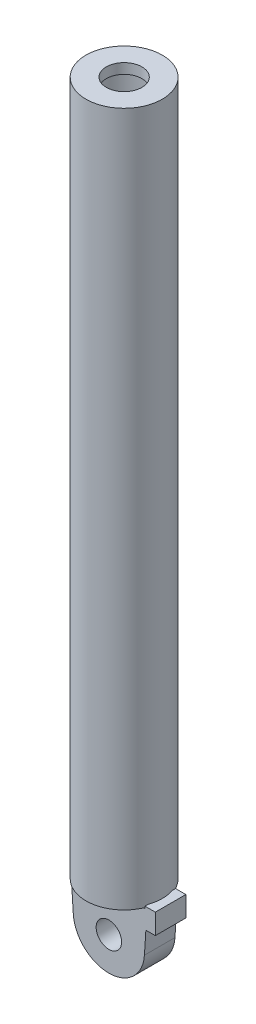
ISO-10303-21;
HEADER;
FILE_DESCRIPTION(('STEP AP214'),'2;1');
FILE_NAME('part.step','',(''),(''),'','','');
FILE_SCHEMA(('AUTOMOTIVE_DESIGN { 1 0 10303 214 1 1 1 1 }'));
ENDSEC;
DATA;
#1=APPLICATION_CONTEXT('core data for automotive mechanical design processes');
#2=APPLICATION_PROTOCOL_DEFINITION('international standard','automotive_design',2000,#1);
#3=PRODUCT_CONTEXT('',#1,'mechanical');
#4=PRODUCT('Part','Part','',(#3));
#5=PRODUCT_RELATED_PRODUCT_CATEGORY('part','',(#4));
#6=PRODUCT_DEFINITION_FORMATION('','',#4);
#7=PRODUCT_DEFINITION_CONTEXT('part definition',#1,'design');
#8=PRODUCT_DEFINITION('design','',#6,#7);
#9=PRODUCT_DEFINITION_SHAPE('','',#8);
#10=(LENGTH_UNIT() NAMED_UNIT(*) SI_UNIT(.MILLI.,.METRE.));
#11=(NAMED_UNIT(*) PLANE_ANGLE_UNIT() SI_UNIT($,.RADIAN.));
#12=(NAMED_UNIT(*) SI_UNIT($,.STERADIAN.) SOLID_ANGLE_UNIT());
#13=UNCERTAINTY_MEASURE_WITH_UNIT(LENGTH_MEASURE(1.E-05),#10,'distance_accuracy_value','');
#14=(GEOMETRIC_REPRESENTATION_CONTEXT(3) GLOBAL_UNCERTAINTY_ASSIGNED_CONTEXT((#13)) GLOBAL_UNIT_ASSIGNED_CONTEXT((#10,
#11,#12)) REPRESENTATION_CONTEXT('',''));
#15=CARTESIAN_POINT('',(0.,0.,0.));
#16=DIRECTION('',(0.,0.,1.));
#17=DIRECTION('',(1.,0.,0.));
#18=AXIS2_PLACEMENT_3D('',#15,#16,#17);
#19=CARTESIAN_POINT('',(35.5,42.,15.));
#20=DIRECTION('',(1.,0.,0.));
#21=DIRECTION('',(0.,0.,-1.));
#22=AXIS2_PLACEMENT_3D('',#19,#20,#21);
#23=PLANE('',#22);
#24=DIRECTION('',(0.,0.,-1.));
#25=VECTOR('',#24,1.);
#26=CARTESIAN_POINT('',(35.5,40.,15.));
#27=LINE('',#26,#25);
#28=CARTESIAN_POINT('',(35.5,40.,-12.0830459735943));
#29=VERTEX_POINT('',#28);
#30=CARTESIAN_POINT('',(35.5,40.,-15.));
#31=VERTEX_POINT('',#30);
#32=EDGE_CURVE('E178',#29,#31,#27,.T.);
#33=ORIENTED_EDGE('',*,*,#32,.F.);
#34=DIRECTION('',(0.,1.,0.));
#35=VECTOR('',#34,1.);
#36=CARTESIAN_POINT('',(35.5,722.,-12.083045973594));
#37=LINE('',#36,#35);
#38=CARTESIAN_POINT('',(35.5,42.,-12.0830459735943));
#39=VERTEX_POINT('',#38);
#40=EDGE_CURVE('E52',#29,#39,#37,.T.);
#41=ORIENTED_EDGE('',*,*,#40,.T.);
#42=DIRECTION('',(0.,0.,-1.));
#43=VECTOR('',#42,1.);
#44=CARTESIAN_POINT('',(35.5,42.,15.));
#45=LINE('',#44,#43);
#46=CARTESIAN_POINT('',(35.5,42.,-15.));
#47=VERTEX_POINT('',#46);
#48=EDGE_CURVE('E46',#39,#47,#45,.T.);
#49=ORIENTED_EDGE('',*,*,#48,.T.);
#50=DIRECTION('',(0.,-1.,0.));
#51=VECTOR('',#50,1.);
#52=CARTESIAN_POINT('',(35.5,42.,-15.));
#53=LINE('',#52,#51);
#54=EDGE_CURVE('E149',#47,#31,#53,.T.);
#55=ORIENTED_EDGE('',*,*,#54,.T.);
#56=EDGE_LOOP('',(#33,#41,#49,#55));
#57=FACE_BOUND('',#56,.T.);
#58=ADVANCED_FACE('F36',(#57),#23,.F.);
#59=CARTESIAN_POINT('',(-37.5,40.,15.));
#60=DIRECTION('',(0.,-1.,0.));
#61=DIRECTION('',(1.,0.,0.));
#62=AXIS2_PLACEMENT_3D('',#59,#60,#61);
#63=PLANE('',#62);
#64=CARTESIAN_POINT('',(35.5,40.,15.));
#65=VERTEX_POINT('',#64);
#66=CARTESIAN_POINT('',(35.5000000000001,40.,12.0830459735943));
#67=VERTEX_POINT('',#66);
#68=EDGE_CURVE('E179',#65,#67,#27,.T.);
#69=ORIENTED_EDGE('',*,*,#68,.T.);
#70=CARTESIAN_POINT('',(0.,40.,0.));
#71=DIRECTION('',(0.,1.,0.));
#72=DIRECTION('',(-1.,0.,0.));
#73=AXIS2_PLACEMENT_3D('',#70,#71,#72);
#74=CIRCLE('',#73,37.5);
#75=CARTESIAN_POINT('',(34.3693177121688,40.,15.));
#76=VERTEX_POINT('',#75);
#77=EDGE_CURVE('E260',#76,#67,#74,.T.);
#78=ORIENTED_EDGE('',*,*,#77,.F.);
#79=DIRECTION('',(-1.,0.,0.));
#80=VECTOR('',#79,1.);
#81=CARTESIAN_POINT('',(-37.5,40.,15.));
#82=LINE('',#81,#80);
#83=EDGE_CURVE('E226',#65,#76,#82,.T.);
#84=ORIENTED_EDGE('',*,*,#83,.F.);
#85=EDGE_LOOP('',(#69,#78,#84));
#86=FACE_BOUND('',#85,.T.);
#87=ADVANCED_FACE('F254',(#86),#63,.F.);
#88=CARTESIAN_POINT('',(-34.3693177121688,40.,15.));
#89=VERTEX_POINT('',#88);
#90=CARTESIAN_POINT('',(-37.5,40.,15.));
#91=VERTEX_POINT('',#90);
#92=EDGE_CURVE('E230',#89,#91,#82,.T.);
#93=ORIENTED_EDGE('',*,*,#92,.F.);
#94=CARTESIAN_POINT('',(-37.5,40.,0.));
#95=VERTEX_POINT('',#94);
#96=EDGE_CURVE('E265',#95,#89,#74,.T.);
#97=ORIENTED_EDGE('',*,*,#96,.F.);
#98=DIRECTION('',(0.,0.,-1.));
#99=VECTOR('',#98,1.);
#100=CARTESIAN_POINT('',(-37.5,40.,15.));
#101=LINE('',#100,#99);
#102=EDGE_CURVE('E175',#91,#95,#101,.T.);
#103=ORIENTED_EDGE('',*,*,#102,.F.);
#104=EDGE_LOOP('',(#93,#97,#103));
#105=FACE_BOUND('',#104,.T.);
#106=ADVANCED_FACE('F301',(#105),#63,.F.);
#107=CARTESIAN_POINT('',(-37.5,40.,-15.));
#108=VERTEX_POINT('',#107);
#109=EDGE_CURVE('E172',#95,#108,#101,.T.);
#110=ORIENTED_EDGE('',*,*,#109,.F.);
#111=CARTESIAN_POINT('',(-34.3693177121688,40.,-15.));
#112=VERTEX_POINT('',#111);
#113=EDGE_CURVE('E270',#112,#95,#74,.T.);
#114=ORIENTED_EDGE('',*,*,#113,.F.);
#115=DIRECTION('',(-1.,0.,0.));
#116=VECTOR('',#115,1.);
#117=CARTESIAN_POINT('',(-37.5,40.,-15.));
#118=LINE('',#117,#116);
#119=EDGE_CURVE('E153',#112,#108,#118,.T.);
#120=ORIENTED_EDGE('',*,*,#119,.T.);
#121=EDGE_LOOP('',(#110,#114,#120));
#122=FACE_BOUND('',#121,.T.);
#123=ADVANCED_FACE('F306',(#122),#63,.F.);
#124=CARTESIAN_POINT('',(0.,2.24598177316563,15.));
#125=DIRECTION('',(0.,0.,1.));
#126=DIRECTION('',(1.,0.,0.));
#127=AXIS2_PLACEMENT_3D('',#124,#125,#126);
#128=PLANE('',#127);
#129=DIRECTION('',(-1.,0.,0.));
#130=VECTOR('',#129,1.);
#131=CARTESIAN_POINT('',(37.628606884265,42.,15.));
#132=LINE('',#131,#130);
#133=CARTESIAN_POINT('',(45.628606884265,42.,15.));
#134=VERTEX_POINT('',#133);
#135=CARTESIAN_POINT('',(35.5,42.,15.));
#136=VERTEX_POINT('',#135);
#137=EDGE_CURVE('E105',#134,#136,#132,.T.);
#138=ORIENTED_EDGE('',*,*,#137,.T.);
#139=DIRECTION('',(0.,-1.,0.));
#140=VECTOR('',#139,1.);
#141=CARTESIAN_POINT('',(35.5,42.,15.));
#142=LINE('',#141,#140);
#143=EDGE_CURVE('E229',#136,#65,#142,.T.);
#144=ORIENTED_EDGE('',*,*,#143,.T.);
#145=ORIENTED_EDGE('',*,*,#83,.T.);
#146=DIRECTION('',(1.,0.,0.));
#147=VECTOR('',#146,1.);
#148=CARTESIAN_POINT('',(0.,40.,15.));
#149=LINE('',#148,#147);
#150=EDGE_CURVE('E204',#89,#76,#149,.T.);
#151=ORIENTED_EDGE('',*,*,#150,.F.);
#152=ORIENTED_EDGE('',*,*,#92,.T.);
#153=DIRECTION('',(0.064170907804732,-0.99793892327713,0.));
#154=VECTOR('',#153,1.);
#155=CARTESIAN_POINT('',(-37.5,40.,15.));
#156=LINE('',#155,#154);
#157=CARTESIAN_POINT('',(-34.9278623146995,0.,15.));
#158=VERTEX_POINT('',#157);
#159=EDGE_CURVE('E232',#91,#158,#156,.T.);
#160=ORIENTED_EDGE('',*,*,#159,.T.);
#161=CARTESIAN_POINT('',(0.,2.24598177316563,15.));
#162=DIRECTION('',(0.,0.,1.));
#163=DIRECTION('',(1.,0.,0.));
#164=AXIS2_PLACEMENT_3D('',#161,#162,#163);
#165=CIRCLE('',#164,35.);
#166=CARTESIAN_POINT('',(34.9278623146995,0.,15.));
#167=VERTEX_POINT('',#166);
#168=EDGE_CURVE('E127',#158,#167,#165,.T.);
#169=ORIENTED_EDGE('',*,*,#168,.T.);
#170=DIRECTION('',(0.0641709078047325,0.99793892327713,0.));
#171=VECTOR('',#170,1.);
#172=CARTESIAN_POINT('',(36.3425380416148,22.,15.));
#173=LINE('',#172,#171);
#174=CARTESIAN_POINT('',(36.3425380416148,22.,15.));
#175=VERTEX_POINT('',#174);
#176=EDGE_CURVE('E117',#167,#175,#173,.T.);
#177=ORIENTED_EDGE('',*,*,#176,.T.);
#178=DIRECTION('',(1.,0.,0.));
#179=VECTOR('',#178,1.);
#180=CARTESIAN_POINT('',(45.628606884265,22.,15.));
#181=LINE('',#180,#179);
#182=CARTESIAN_POINT('',(45.628606884265,22.,15.));
#183=VERTEX_POINT('',#182);
#184=EDGE_CURVE('E122',#175,#183,#181,.T.);
#185=ORIENTED_EDGE('',*,*,#184,.T.);
#186=DIRECTION('',(0.,1.,0.));
#187=VECTOR('',#186,1.);
#188=CARTESIAN_POINT('',(45.628606884265,42.,15.));
#189=LINE('',#188,#187);
#190=EDGE_CURVE('E64',#183,#134,#189,.T.);
#191=ORIENTED_EDGE('',*,*,#190,.T.);
#192=EDGE_LOOP('',(#138,#144,#145,#151,#152,#160,#169,#177,#185,#191));
#193=FACE_BOUND('',#192,.T.);
#194=CARTESIAN_POINT('',(0.,0.,15.));
#195=DIRECTION('',(0.,0.,1.));
#196=DIRECTION('',(1.,0.,0.));
#197=AXIS2_PLACEMENT_3D('',#194,#195,#196);
#198=CIRCLE('',#197,12.5);
#199=CARTESIAN_POINT('',(12.5,0.,15.));
#200=VERTEX_POINT('',#199);
#201=EDGE_CURVE('E147',#200,#200,#198,.T.);
#202=ORIENTED_EDGE('',*,*,#201,.F.);
#203=EDGE_LOOP('',(#202));
#204=FACE_BOUND('',#203,.T.);
#205=ADVANCED_FACE('F116',(#193,#204),#128,.T.);
#206=CARTESIAN_POINT('',(0.,2.24598177316563,-15.));
#207=DIRECTION('',(0.,0.,1.));
#208=DIRECTION('',(1.,0.,0.));
#209=AXIS2_PLACEMENT_3D('',#206,#207,#208);
#210=PLANE('',#209);
#211=DIRECTION('',(-1.,0.,0.));
#212=VECTOR('',#211,1.);
#213=CARTESIAN_POINT('',(37.628606884265,42.,-15.));
#214=LINE('',#213,#212);
#215=CARTESIAN_POINT('',(45.628606884265,42.,-15.));
#216=VERTEX_POINT('',#215);
#217=EDGE_CURVE('E96',#216,#47,#214,.T.);
#218=ORIENTED_EDGE('',*,*,#217,.F.);
#219=DIRECTION('',(0.,1.,0.));
#220=VECTOR('',#219,1.);
#221=CARTESIAN_POINT('',(45.628606884265,42.,-15.));
#222=LINE('',#221,#220);
#223=CARTESIAN_POINT('',(45.628606884265,22.,-15.));
#224=VERTEX_POINT('',#223);
#225=EDGE_CURVE('E163',#224,#216,#222,.T.);
#226=ORIENTED_EDGE('',*,*,#225,.F.);
#227=DIRECTION('',(1.,0.,0.));
#228=VECTOR('',#227,1.);
#229=CARTESIAN_POINT('',(45.628606884265,22.,-15.));
#230=LINE('',#229,#228);
#231=CARTESIAN_POINT('',(36.3425380416148,22.,-15.));
#232=VERTEX_POINT('',#231);
#233=EDGE_CURVE('E165',#232,#224,#230,.T.);
#234=ORIENTED_EDGE('',*,*,#233,.F.);
#235=DIRECTION('',(0.0641709078047325,0.99793892327713,0.));
#236=VECTOR('',#235,1.);
#237=CARTESIAN_POINT('',(36.3425380416148,22.,-15.));
#238=LINE('',#237,#236);
#239=CARTESIAN_POINT('',(34.9278623146995,0.,-15.));
#240=VERTEX_POINT('',#239);
#241=EDGE_CURVE('E131',#240,#232,#238,.T.);
#242=ORIENTED_EDGE('',*,*,#241,.F.);
#243=CARTESIAN_POINT('',(0.,2.24598177316563,-15.));
#244=DIRECTION('',(0.,0.,1.));
#245=DIRECTION('',(1.,0.,0.));
#246=AXIS2_PLACEMENT_3D('',#243,#244,#245);
#247=CIRCLE('',#246,35.);
#248=CARTESIAN_POINT('',(-34.9278623146995,0.,-15.));
#249=VERTEX_POINT('',#248);
#250=EDGE_CURVE('E157',#249,#240,#247,.T.);
#251=ORIENTED_EDGE('',*,*,#250,.F.);
#252=DIRECTION('',(0.064170907804732,-0.99793892327713,0.));
#253=VECTOR('',#252,1.);
#254=CARTESIAN_POINT('',(-37.5,40.,-15.));
#255=LINE('',#254,#253);
#256=EDGE_CURVE('E160',#108,#249,#255,.T.);
#257=ORIENTED_EDGE('',*,*,#256,.F.);
#258=ORIENTED_EDGE('',*,*,#119,.F.);
#259=DIRECTION('',(1.,0.,0.));
#260=VECTOR('',#259,1.);
#261=CARTESIAN_POINT('',(0.,40.,-15.));
#262=LINE('',#261,#260);
#263=CARTESIAN_POINT('',(34.3693177121688,40.,-15.));
#264=VERTEX_POINT('',#263);
#265=EDGE_CURVE('E197',#112,#264,#262,.T.);
#266=ORIENTED_EDGE('',*,*,#265,.T.);
#267=EDGE_CURVE('E152',#31,#264,#118,.T.);
#268=ORIENTED_EDGE('',*,*,#267,.F.);
#269=ORIENTED_EDGE('',*,*,#54,.F.);
#270=EDGE_LOOP('',(#218,#226,#234,#242,#251,#257,#258,#266,#268,#269));
#271=FACE_BOUND('',#270,.T.);
#272=CARTESIAN_POINT('',(0.,0.,-15.));
#273=DIRECTION('',(0.,0.,1.));
#274=DIRECTION('',(1.,0.,0.));
#275=AXIS2_PLACEMENT_3D('',#272,#273,#274);
#276=CIRCLE('',#275,12.5);
#277=CARTESIAN_POINT('',(12.5,0.,-15.));
#278=VERTEX_POINT('',#277);
#279=EDGE_CURVE('E222',#278,#278,#276,.T.);
#280=ORIENTED_EDGE('',*,*,#279,.T.);
#281=EDGE_LOOP('',(#280));
#282=FACE_BOUND('',#281,.T.);
#283=ADVANCED_FACE('F192',(#271,#282),#210,.F.);
#284=CARTESIAN_POINT('',(37.628606884265,42.,15.));
#285=DIRECTION('',(0.,-1.,0.));
#286=DIRECTION('',(0.,0.,-1.));
#287=AXIS2_PLACEMENT_3D('',#284,#285,#286);
#288=PLANE('',#287);
#289=ORIENTED_EDGE('',*,*,#48,.F.);
#290=CARTESIAN_POINT('',(0.,42.,0.));
#291=DIRECTION('',(0.,-1.,0.));
#292=DIRECTION('',(0.,0.,-1.));
#293=AXIS2_PLACEMENT_3D('',#290,#291,#292);
#294=CIRCLE('',#293,37.4999999999999);
#295=CARTESIAN_POINT('',(35.5000000000001,41.9999999999999,12.083045973594));
#296=VERTEX_POINT('',#295);
#297=EDGE_CURVE('E220',#39,#296,#294,.T.);
#298=ORIENTED_EDGE('',*,*,#297,.T.);
#299=EDGE_CURVE('E11',#136,#296,#45,.T.);
#300=ORIENTED_EDGE('',*,*,#299,.F.);
#301=ORIENTED_EDGE('',*,*,#137,.F.);
#302=DIRECTION('',(0.,0.,-1.));
#303=VECTOR('',#302,1.);
#304=CARTESIAN_POINT('',(45.628606884265,42.,15.));
#305=LINE('',#304,#303);
#306=EDGE_CURVE('E145',#134,#216,#305,.T.);
#307=ORIENTED_EDGE('',*,*,#306,.T.);
#308=ORIENTED_EDGE('',*,*,#217,.T.);
#309=EDGE_LOOP('',(#289,#298,#300,#301,#307,#308));
#310=FACE_BOUND('',#309,.T.);
#311=ADVANCED_FACE('F37',(#310),#288,.F.);
#312=ORIENTED_EDGE('',*,*,#299,.T.);
#313=DIRECTION('',(0.,1.,0.));
#314=VECTOR('',#313,1.);
#315=CARTESIAN_POINT('',(35.5,722.,12.083045973594));
#316=LINE('',#315,#314);
#317=EDGE_CURVE('E208',#296,#67,#316,.F.);
#318=ORIENTED_EDGE('',*,*,#317,.T.);
#319=ORIENTED_EDGE('',*,*,#68,.F.);
#320=ORIENTED_EDGE('',*,*,#143,.F.);
#321=EDGE_LOOP('',(#312,#318,#319,#320));
#322=FACE_BOUND('',#321,.T.);
#323=ADVANCED_FACE('F253',(#322),#23,.F.);
#324=ORIENTED_EDGE('',*,*,#267,.T.);
#325=EDGE_CURVE('E190',#29,#264,#74,.T.);
#326=ORIENTED_EDGE('',*,*,#325,.F.);
#327=ORIENTED_EDGE('',*,*,#32,.T.);
#328=EDGE_LOOP('',(#324,#326,#327));
#329=FACE_BOUND('',#328,.T.);
#330=ADVANCED_FACE('F188',(#329),#63,.F.);
#331=CARTESIAN_POINT('',(-37.5,40.,15.));
#332=DIRECTION('',(0.99793892327713,0.064170907804732,0.));
#333=DIRECTION('',(-0.064170907804732,0.99793892327713,0.));
#334=AXIS2_PLACEMENT_3D('',#331,#332,#333);
#335=PLANE('',#334);
#336=ORIENTED_EDGE('',*,*,#256,.T.);
#337=DIRECTION('',(0.,0.,-1.));
#338=VECTOR('',#337,1.);
#339=CARTESIAN_POINT('',(-34.9278623146995,0.,15.));
#340=LINE('',#339,#338);
#341=EDGE_CURVE('E168',#158,#249,#340,.T.);
#342=ORIENTED_EDGE('',*,*,#341,.F.);
#343=ORIENTED_EDGE('',*,*,#159,.F.);
#344=ORIENTED_EDGE('',*,*,#102,.T.);
#345=ORIENTED_EDGE('',*,*,#109,.T.);
#346=EDGE_LOOP('',(#336,#342,#343,#344,#345));
#347=FACE_BOUND('',#346,.T.);
#348=ADVANCED_FACE('F238',(#347),#335,.F.);
#349=CARTESIAN_POINT('',(0.,2.24598177316563,15.));
#350=DIRECTION('',(0.,0.,-1.));
#351=DIRECTION('',(-1.,0.,0.));
#352=AXIS2_PLACEMENT_3D('',#349,#350,#351);
#353=CYLINDRICAL_SURFACE('',#352,35.);
#354=ORIENTED_EDGE('',*,*,#250,.T.);
#355=DIRECTION('',(0.,0.,-1.));
#356=VECTOR('',#355,1.);
#357=CARTESIAN_POINT('',(34.9278623146995,0.,15.));
#358=LINE('',#357,#356);
#359=EDGE_CURVE('E137',#167,#240,#358,.T.);
#360=ORIENTED_EDGE('',*,*,#359,.F.);
#361=ORIENTED_EDGE('',*,*,#168,.F.);
#362=ORIENTED_EDGE('',*,*,#341,.T.);
#363=EDGE_LOOP('',(#354,#360,#361,#362));
#364=FACE_BOUND('',#363,.T.);
#365=ADVANCED_FACE('F245',(#364),#353,.T.);
#366=CARTESIAN_POINT('',(36.3425380416148,22.,15.));
#367=DIRECTION('',(-0.99793892327713,0.0641709078047325,0.));
#368=DIRECTION('',(-0.0641709078047325,-0.99793892327713,0.));
#369=AXIS2_PLACEMENT_3D('',#366,#367,#368);
#370=PLANE('',#369);
#371=ORIENTED_EDGE('',*,*,#241,.T.);
#372=DIRECTION('',(0.,0.,-1.));
#373=VECTOR('',#372,1.);
#374=CARTESIAN_POINT('',(36.3425380416148,22.,15.));
#375=LINE('',#374,#373);
#376=EDGE_CURVE('E134',#175,#232,#375,.T.);
#377=ORIENTED_EDGE('',*,*,#376,.F.);
#378=ORIENTED_EDGE('',*,*,#176,.F.);
#379=ORIENTED_EDGE('',*,*,#359,.T.);
#380=EDGE_LOOP('',(#371,#377,#378,#379));
#381=FACE_BOUND('',#380,.T.);
#382=ADVANCED_FACE('F132',(#381),#370,.F.);
#383=CARTESIAN_POINT('',(45.628606884265,22.,15.));
#384=DIRECTION('',(0.,1.,0.));
#385=DIRECTION('',(0.,0.,1.));
#386=AXIS2_PLACEMENT_3D('',#383,#384,#385);
#387=PLANE('',#386);
#388=ORIENTED_EDGE('',*,*,#233,.T.);
#389=DIRECTION('',(0.,0.,-1.));
#390=VECTOR('',#389,1.);
#391=CARTESIAN_POINT('',(45.628606884265,22.,15.));
#392=LINE('',#391,#390);
#393=EDGE_CURVE('E138',#183,#224,#392,.T.);
#394=ORIENTED_EDGE('',*,*,#393,.F.);
#395=ORIENTED_EDGE('',*,*,#184,.F.);
#396=ORIENTED_EDGE('',*,*,#376,.T.);
#397=EDGE_LOOP('',(#388,#394,#395,#396));
#398=FACE_BOUND('',#397,.T.);
#399=ADVANCED_FACE('F143',(#398),#387,.F.);
#400=CARTESIAN_POINT('',(45.628606884265,42.,15.));
#401=DIRECTION('',(-1.,0.,0.));
#402=DIRECTION('',(0.,0.,1.));
#403=AXIS2_PLACEMENT_3D('',#400,#401,#402);
#404=PLANE('',#403);
#405=ORIENTED_EDGE('',*,*,#225,.T.);
#406=ORIENTED_EDGE('',*,*,#306,.F.);
#407=ORIENTED_EDGE('',*,*,#190,.F.);
#408=ORIENTED_EDGE('',*,*,#393,.T.);
#409=EDGE_LOOP('',(#405,#406,#407,#408));
#410=FACE_BOUND('',#409,.T.);
#411=ADVANCED_FACE('F246',(#410),#404,.F.);
#412=CARTESIAN_POINT('',(0.,0.,15.));
#413=DIRECTION('',(0.,0.,-1.));
#414=DIRECTION('',(-1.,0.,0.));
#415=AXIS2_PLACEMENT_3D('',#412,#413,#414);
#416=CYLINDRICAL_SURFACE('',#415,12.5);
#417=ORIENTED_EDGE('',*,*,#201,.T.);
#418=EDGE_LOOP('',(#417));
#419=FACE_BOUND('',#418,.T.);
#420=ORIENTED_EDGE('',*,*,#279,.F.);
#421=EDGE_LOOP('',(#420));
#422=FACE_BOUND('',#421,.T.);
#423=ADVANCED_FACE('F321',(#419,#422),#416,.F.);
#424=CARTESIAN_POINT('',(0.,722.,0.));
#425=DIRECTION('',(0.,1.,0.));
#426=DIRECTION('',(-1.,0.,0.));
#427=AXIS2_PLACEMENT_3D('',#424,#425,#426);
#428=CYLINDRICAL_SURFACE('',#427,37.4999999999999);
#429=CARTESIAN_POINT('',(0.,722.,0.));
#430=DIRECTION('',(0.,1.,0.));
#431=DIRECTION('',(-1.,0.,0.));
#432=AXIS2_PLACEMENT_3D('',#429,#430,#431);
#433=CIRCLE('',#432,37.4999999999998);
#434=CARTESIAN_POINT('',(-37.4999999999999,722.,0.));
#435=VERTEX_POINT('',#434);
#436=EDGE_CURVE('E202',#435,#435,#433,.T.);
#437=ORIENTED_EDGE('',*,*,#436,.F.);
#438=EDGE_LOOP('',(#437));
#439=FACE_BOUND('',#438,.T.);
#440=ORIENTED_EDGE('',*,*,#40,.F.);
#441=ORIENTED_EDGE('',*,*,#325,.T.);
#442=EDGE_CURVE('E263',#264,#112,#74,.T.);
#443=ORIENTED_EDGE('',*,*,#442,.T.);
#444=ORIENTED_EDGE('',*,*,#113,.T.);
#445=ORIENTED_EDGE('',*,*,#96,.T.);
#446=EDGE_CURVE('E257',#89,#76,#74,.T.);
#447=ORIENTED_EDGE('',*,*,#446,.T.);
#448=ORIENTED_EDGE('',*,*,#77,.T.);
#449=ORIENTED_EDGE('',*,*,#317,.F.);
#450=ORIENTED_EDGE('',*,*,#297,.F.);
#451=EDGE_LOOP('',(#440,#441,#443,#444,#445,#447,#448,#449,#450));
#452=FACE_BOUND('',#451,.T.);
#453=ADVANCED_FACE('F339',(#439,#452),#428,.T.);
#454=CARTESIAN_POINT('',(0.,40.,0.));
#455=DIRECTION('',(0.,-1.,0.));
#456=DIRECTION('',(1.,0.,0.));
#457=AXIS2_PLACEMENT_3D('',#454,#455,#456);
#458=PLANE('',#457);
#459=ORIENTED_EDGE('',*,*,#265,.F.);
#460=ORIENTED_EDGE('',*,*,#442,.F.);
#461=EDGE_LOOP('',(#459,#460));
#462=FACE_BOUND('',#461,.T.);
#463=ADVANCED_FACE('F295',(#462),#458,.T.);
#464=ORIENTED_EDGE('',*,*,#446,.F.);
#465=ORIENTED_EDGE('',*,*,#150,.T.);
#466=EDGE_LOOP('',(#464,#465));
#467=FACE_BOUND('',#466,.T.);
#468=ADVANCED_FACE('F282',(#467),#458,.T.);
#469=CARTESIAN_POINT('',(-37.4999999999999,722.,0.));
#470=DIRECTION('',(0.,1.,0.));
#471=DIRECTION('',(-1.,0.,0.));
#472=AXIS2_PLACEMENT_3D('',#469,#470,#471);
#473=PLANE('',#472);
#474=ORIENTED_EDGE('',*,*,#436,.T.);
#475=EDGE_LOOP('',(#474));
#476=FACE_BOUND('',#475,.T.);
#477=CARTESIAN_POINT('',(0.,722.,0.));
#478=DIRECTION('',(0.,1.,0.));
#479=DIRECTION('',(-1.,0.,0.));
#480=AXIS2_PLACEMENT_3D('',#477,#478,#479);
#481=CIRCLE('',#480,17.5);
#482=CARTESIAN_POINT('',(-17.5000000000001,722.,0.));
#483=VERTEX_POINT('',#482);
#484=EDGE_CURVE('E211',#483,#483,#481,.T.);
#485=ORIENTED_EDGE('',*,*,#484,.F.);
#486=EDGE_LOOP('',(#485));
#487=FACE_BOUND('',#486,.T.);
#488=ADVANCED_FACE('F283',(#476,#487),#473,.T.);
#489=CARTESIAN_POINT('',(0.,722.,0.));
#490=DIRECTION('',(0.,1.,0.));
#491=DIRECTION('',(-1.,0.,0.));
#492=AXIS2_PLACEMENT_3D('',#489,#490,#491);
#493=CYLINDRICAL_SURFACE('',#492,17.5);
#494=ORIENTED_EDGE('',*,*,#484,.T.);
#495=EDGE_LOOP('',(#494));
#496=FACE_BOUND('',#495,.T.);
#497=CARTESIAN_POINT('',(0.,712.,0.));
#498=DIRECTION('',(0.,1.,0.));
#499=DIRECTION('',(-1.,0.,0.));
#500=AXIS2_PLACEMENT_3D('',#497,#498,#499);
#501=CIRCLE('',#500,17.5);
#502=CARTESIAN_POINT('',(-17.5000000000001,712.,0.));
#503=VERTEX_POINT('',#502);
#504=EDGE_CURVE('E272',#503,#503,#501,.T.);
#505=ORIENTED_EDGE('',*,*,#504,.F.);
#506=EDGE_LOOP('',(#505));
#507=FACE_BOUND('',#506,.T.);
#508=ADVANCED_FACE('F279',(#496,#507),#493,.F.);
#509=CARTESIAN_POINT('',(-17.5000000000001,712.,0.));
#510=DIRECTION('',(0.,-1.,0.));
#511=DIRECTION('',(1.,0.,0.));
#512=AXIS2_PLACEMENT_3D('',#509,#510,#511);
#513=PLANE('',#512);
#514=ORIENTED_EDGE('',*,*,#504,.T.);
#515=EDGE_LOOP('',(#514));
#516=FACE_BOUND('',#515,.T.);
#517=CARTESIAN_POINT('',(0.,712.,0.));
#518=DIRECTION('',(0.,1.,0.));
#519=DIRECTION('',(-1.,0.,0.));
#520=AXIS2_PLACEMENT_3D('',#517,#518,#519);
#521=CIRCLE('',#520,32.4999999999999);
#522=CARTESIAN_POINT('',(-32.5,712.,0.));
#523=VERTEX_POINT('',#522);
#524=EDGE_CURVE('E269',#523,#523,#521,.T.);
#525=ORIENTED_EDGE('',*,*,#524,.F.);
#526=EDGE_LOOP('',(#525));
#527=FACE_BOUND('',#526,.T.);
#528=ADVANCED_FACE('F286',(#516,#527),#513,.T.);
#529=CARTESIAN_POINT('',(0.,722.,0.));
#530=DIRECTION('',(0.,1.,0.));
#531=DIRECTION('',(-1.,0.,0.));
#532=AXIS2_PLACEMENT_3D('',#529,#530,#531);
#533=CYLINDRICAL_SURFACE('',#532,32.4999999999999);
#534=ORIENTED_EDGE('',*,*,#524,.T.);
#535=EDGE_LOOP('',(#534));
#536=FACE_BOUND('',#535,.T.);
#537=CARTESIAN_POINT('',(0.,172.,0.));
#538=DIRECTION('',(0.,1.,0.));
#539=DIRECTION('',(-1.,0.,0.));
#540=AXIS2_PLACEMENT_3D('',#537,#538,#539);
#541=CIRCLE('',#540,32.4999999999999);
#542=CARTESIAN_POINT('',(-32.4999999999999,172.,0.));
#543=VERTEX_POINT('',#542);
#544=EDGE_CURVE('E266',#543,#543,#541,.T.);
#545=ORIENTED_EDGE('',*,*,#544,.F.);
#546=EDGE_LOOP('',(#545));
#547=FACE_BOUND('',#546,.T.);
#548=ADVANCED_FACE('F361',(#536,#547),#533,.F.);
#549=CARTESIAN_POINT('',(-32.4999999999999,172.,0.));
#550=DIRECTION('',(0.,1.,0.));
#551=DIRECTION('',(-1.,0.,0.));
#552=AXIS2_PLACEMENT_3D('',#549,#550,#551);
#553=PLANE('',#552);
#554=ORIENTED_EDGE('',*,*,#544,.T.);
#555=EDGE_LOOP('',(#554));
#556=FACE_BOUND('',#555,.T.);
#557=ADVANCED_FACE('F371',(#556),#553,.T.);
#558=CLOSED_SHELL('',(#58,#87,#106,#123,#205,#283,#311,#323,#330,#348,#365,#382,#399,#411,#423,
#453,#463,#468,#488,#508,#528,#548,#557));
#559=MANIFOLD_SOLID_BREP('B2',#558);
#560=ADVANCED_BREP_SHAPE_REPRESENTATION('',(#18,#559),#14);
#561=SHAPE_DEFINITION_REPRESENTATION(#9,#560);
ENDSEC;
END-ISO-10303-21;
